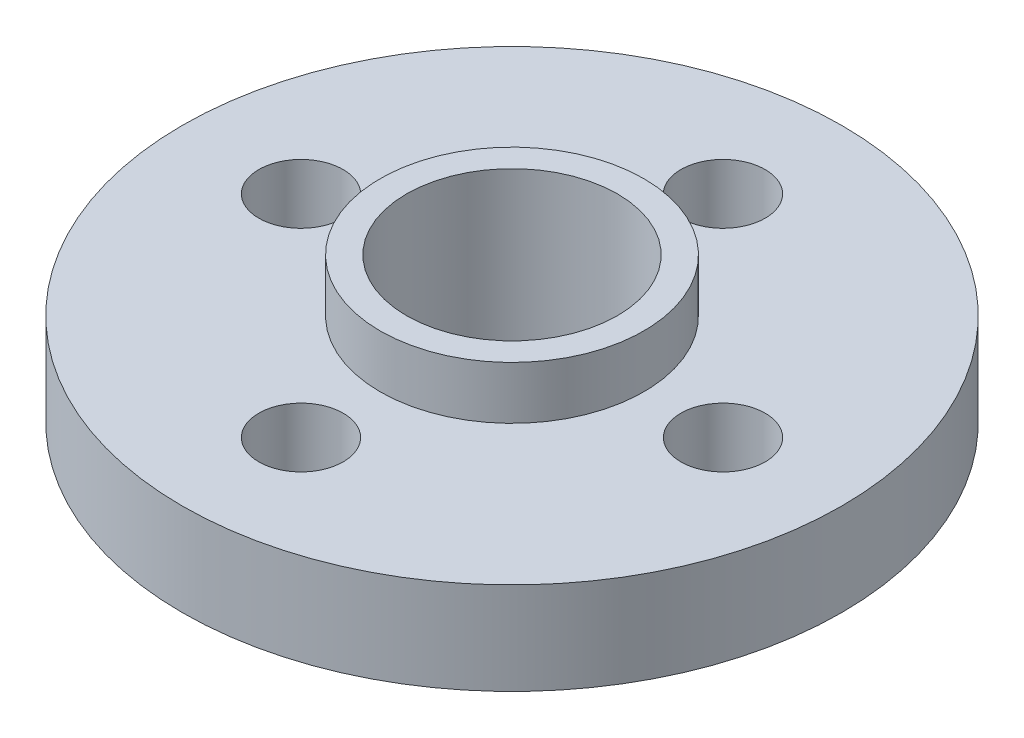
ISO-10303-21;
HEADER;
FILE_DESCRIPTION(('STEP AP214'),'2;1');
FILE_NAME('part.step','',(''),(''),'','','');
FILE_SCHEMA(('AUTOMOTIVE_DESIGN { 1 0 10303 214 1 1 1 1 }'));
ENDSEC;
DATA;
#1=APPLICATION_CONTEXT('core data for automotive mechanical design processes');
#2=APPLICATION_PROTOCOL_DEFINITION('international standard','automotive_design',2000,#1);
#3=PRODUCT_CONTEXT('',#1,'mechanical');
#4=PRODUCT('Part','Part','',(#3));
#5=PRODUCT_RELATED_PRODUCT_CATEGORY('part','',(#4));
#6=PRODUCT_DEFINITION_FORMATION('','',#4);
#7=PRODUCT_DEFINITION_CONTEXT('part definition',#1,'design');
#8=PRODUCT_DEFINITION('design','',#6,#7);
#9=PRODUCT_DEFINITION_SHAPE('','',#8);
#10=(LENGTH_UNIT() NAMED_UNIT(*) SI_UNIT(.MILLI.,.METRE.));
#11=(NAMED_UNIT(*) PLANE_ANGLE_UNIT() SI_UNIT($,.RADIAN.));
#12=(NAMED_UNIT(*) SI_UNIT($,.STERADIAN.) SOLID_ANGLE_UNIT());
#13=UNCERTAINTY_MEASURE_WITH_UNIT(LENGTH_MEASURE(1.E-05),#10,'distance_accuracy_value','');
#14=(GEOMETRIC_REPRESENTATION_CONTEXT(3) GLOBAL_UNCERTAINTY_ASSIGNED_CONTEXT((#13)) GLOBAL_UNIT_ASSIGNED_CONTEXT((#10,
#11,#12)) REPRESENTATION_CONTEXT('',''));
#15=CARTESIAN_POINT('',(0.,0.,0.));
#16=DIRECTION('',(0.,0.,1.));
#17=DIRECTION('',(1.,0.,0.));
#18=AXIS2_PLACEMENT_3D('',#15,#16,#17);
#19=CARTESIAN_POINT('',(0.,0.,0.));
#20=DIRECTION('',(0.,1.,0.));
#21=DIRECTION('',(0.,0.,1.));
#22=AXIS2_PLACEMENT_3D('',#19,#20,#21);
#23=PLANE('',#22);
#24=CARTESIAN_POINT('',(0.,0.,-8.));
#25=DIRECTION('',(0.,1.,0.));
#26=DIRECTION('',(0.,0.,1.));
#27=AXIS2_PLACEMENT_3D('',#24,#25,#26);
#28=CIRCLE('',#27,1.6);
#29=CARTESIAN_POINT('',(0.,0.,-6.4));
#30=VERTEX_POINT('',#29);
#31=EDGE_CURVE('E67',#30,#30,#28,.T.);
#32=ORIENTED_EDGE('',*,*,#31,.T.);
#33=EDGE_LOOP('',(#32));
#34=FACE_BOUND('',#33,.T.);
#35=CARTESIAN_POINT('',(8.00000000000023,0.,-2.25904099284255E-13));
#36=DIRECTION('',(0.,1.,0.));
#37=DIRECTION('',(0.,0.,1.));
#38=AXIS2_PLACEMENT_3D('',#35,#36,#37);
#39=CIRCLE('',#38,1.60000000000018);
#40=CARTESIAN_POINT('',(8.00000000000023,0.,1.59999999999995));
#41=VERTEX_POINT('',#40);
#42=EDGE_CURVE('E70',#41,#41,#39,.T.);
#43=ORIENTED_EDGE('',*,*,#42,.T.);
#44=EDGE_LOOP('',(#43));
#45=FACE_BOUND('',#44,.T.);
#46=CARTESIAN_POINT('',(4.51808198568511E-13,0.,8.));
#47=DIRECTION('',(0.,1.,0.));
#48=DIRECTION('',(0.,0.,1.));
#49=AXIS2_PLACEMENT_3D('',#46,#47,#48);
#50=CIRCLE('',#49,1.60000000000049);
#51=CARTESIAN_POINT('',(4.51808198568511E-13,0.,9.60000000000049));
#52=VERTEX_POINT('',#51);
#53=EDGE_CURVE('E73',#52,#52,#50,.T.);
#54=ORIENTED_EDGE('',*,*,#53,.T.);
#55=EDGE_LOOP('',(#54));
#56=FACE_BOUND('',#55,.T.);
#57=CARTESIAN_POINT('',(-7.99999999999977,0.,2.26883816723573E-13));
#58=DIRECTION('',(0.,1.,0.));
#59=DIRECTION('',(0.,0.,1.));
#60=AXIS2_PLACEMENT_3D('',#57,#58,#59);
#61=CIRCLE('',#60,1.60000000000036);
#62=CARTESIAN_POINT('',(-7.99999999999977,0.,1.60000000000059));
#63=VERTEX_POINT('',#62);
#64=EDGE_CURVE('E76',#63,#63,#61,.T.);
#65=ORIENTED_EDGE('',*,*,#64,.T.);
#66=EDGE_LOOP('',(#65));
#67=FACE_BOUND('',#66,.T.);
#68=CARTESIAN_POINT('',(0.,0.,0.));
#69=DIRECTION('',(0.,1.,0.));
#70=DIRECTION('',(0.,0.,1.));
#71=AXIS2_PLACEMENT_3D('',#68,#69,#70);
#72=CIRCLE('',#71,12.5);
#73=CARTESIAN_POINT('',(0.,0.,12.5));
#74=VERTEX_POINT('',#73);
#75=EDGE_CURVE('E46',#74,#74,#72,.T.);
#76=ORIENTED_EDGE('',*,*,#75,.F.);
#77=EDGE_LOOP('',(#76));
#78=FACE_BOUND('',#77,.T.);
#79=CARTESIAN_POINT('',(0.,0.,0.));
#80=DIRECTION('',(0.,1.,0.));
#81=DIRECTION('',(0.,0.,1.));
#82=AXIS2_PLACEMENT_3D('',#79,#80,#81);
#83=CIRCLE('',#82,5.);
#84=CARTESIAN_POINT('',(0.,0.,5.));
#85=VERTEX_POINT('',#84);
#86=EDGE_CURVE('E10',#85,#85,#83,.F.);
#87=ORIENTED_EDGE('',*,*,#86,.F.);
#88=EDGE_LOOP('',(#87));
#89=FACE_BOUND('',#88,.T.);
#90=ADVANCED_FACE('F35',(#34,#45,#56,#67,#78,#89),#23,.F.);
#91=CARTESIAN_POINT('',(0.,3.5,0.));
#92=DIRECTION('',(0.,1.,0.));
#93=DIRECTION('',(0.,0.,1.));
#94=AXIS2_PLACEMENT_3D('',#91,#92,#93);
#95=PLANE('',#94);
#96=CARTESIAN_POINT('',(0.,3.5,-8.));
#97=DIRECTION('',(0.,1.,0.));
#98=DIRECTION('',(0.,0.,1.));
#99=AXIS2_PLACEMENT_3D('',#96,#97,#98);
#100=CIRCLE('',#99,1.6);
#101=CARTESIAN_POINT('',(0.,3.5,-6.4));
#102=VERTEX_POINT('',#101);
#103=EDGE_CURVE('E79',#102,#102,#100,.T.);
#104=ORIENTED_EDGE('',*,*,#103,.F.);
#105=EDGE_LOOP('',(#104));
#106=FACE_BOUND('',#105,.T.);
#107=CARTESIAN_POINT('',(8.00000000000023,3.5,-2.25904099284255E-13));
#108=DIRECTION('',(0.,1.,0.));
#109=DIRECTION('',(0.,0.,1.));
#110=AXIS2_PLACEMENT_3D('',#107,#108,#109);
#111=CIRCLE('',#110,1.60000000000018);
#112=CARTESIAN_POINT('',(8.00000000000023,3.5,1.59999999999995));
#113=VERTEX_POINT('',#112);
#114=EDGE_CURVE('E86',#113,#113,#111,.T.);
#115=ORIENTED_EDGE('',*,*,#114,.F.);
#116=EDGE_LOOP('',(#115));
#117=FACE_BOUND('',#116,.T.);
#118=CARTESIAN_POINT('',(4.51808198568511E-13,3.5,8.));
#119=DIRECTION('',(0.,1.,0.));
#120=DIRECTION('',(0.,0.,1.));
#121=AXIS2_PLACEMENT_3D('',#118,#119,#120);
#122=CIRCLE('',#121,1.60000000000049);
#123=CARTESIAN_POINT('',(4.51808198568511E-13,3.5,9.60000000000049));
#124=VERTEX_POINT('',#123);
#125=EDGE_CURVE('E83',#124,#124,#122,.T.);
#126=ORIENTED_EDGE('',*,*,#125,.F.);
#127=EDGE_LOOP('',(#126));
#128=FACE_BOUND('',#127,.T.);
#129=CARTESIAN_POINT('',(-7.99999999999977,3.5,2.26883816723573E-13));
#130=DIRECTION('',(0.,1.,0.));
#131=DIRECTION('',(0.,0.,1.));
#132=AXIS2_PLACEMENT_3D('',#129,#130,#131);
#133=CIRCLE('',#132,1.60000000000036);
#134=CARTESIAN_POINT('',(-7.99999999999977,3.5,1.60000000000059));
#135=VERTEX_POINT('',#134);
#136=EDGE_CURVE('E80',#135,#135,#133,.T.);
#137=ORIENTED_EDGE('',*,*,#136,.F.);
#138=EDGE_LOOP('',(#137));
#139=FACE_BOUND('',#138,.T.);
#140=CARTESIAN_POINT('',(0.,3.5,0.));
#141=DIRECTION('',(0.,1.,0.));
#142=DIRECTION('',(0.,0.,1.));
#143=AXIS2_PLACEMENT_3D('',#140,#141,#142);
#144=CIRCLE('',#143,12.5);
#145=CARTESIAN_POINT('',(0.,3.5,12.5));
#146=VERTEX_POINT('',#145);
#147=EDGE_CURVE('E42',#146,#146,#144,.T.);
#148=ORIENTED_EDGE('',*,*,#147,.T.);
#149=EDGE_LOOP('',(#148));
#150=FACE_BOUND('',#149,.T.);
#151=CARTESIAN_POINT('',(0.,3.5,0.));
#152=DIRECTION('',(0.,1.,0.));
#153=DIRECTION('',(0.,0.,1.));
#154=AXIS2_PLACEMENT_3D('',#151,#152,#153);
#155=CIRCLE('',#154,5.);
#156=CARTESIAN_POINT('',(0.,3.5,5.));
#157=VERTEX_POINT('',#156);
#158=EDGE_CURVE('E53',#157,#157,#155,.T.);
#159=ORIENTED_EDGE('',*,*,#158,.F.);
#160=EDGE_LOOP('',(#159));
#161=FACE_BOUND('',#160,.T.);
#162=ADVANCED_FACE('F95',(#106,#117,#128,#139,#150,#161),#95,.T.);
#163=CARTESIAN_POINT('',(0.,3.5,0.));
#164=DIRECTION('',(0.,-1.,0.));
#165=DIRECTION('',(0.,0.,-1.));
#166=AXIS2_PLACEMENT_3D('',#163,#164,#165);
#167=CYLINDRICAL_SURFACE('',#166,12.5);
#168=ORIENTED_EDGE('',*,*,#147,.F.);
#169=EDGE_LOOP('',(#168));
#170=FACE_BOUND('',#169,.T.);
#171=ORIENTED_EDGE('',*,*,#75,.T.);
#172=EDGE_LOOP('',(#171));
#173=FACE_BOUND('',#172,.T.);
#174=ADVANCED_FACE('F37',(#170,#173),#167,.T.);
#175=CARTESIAN_POINT('',(0.,3.5,0.));
#176=DIRECTION('',(0.,-1.,0.));
#177=DIRECTION('',(0.,0.,-1.));
#178=AXIS2_PLACEMENT_3D('',#175,#176,#177);
#179=CYLINDRICAL_SURFACE('',#178,4.);
#180=CARTESIAN_POINT('',(0.,5.5,0.));
#181=DIRECTION('',(0.,1.,0.));
#182=DIRECTION('',(0.,0.,1.));
#183=AXIS2_PLACEMENT_3D('',#180,#181,#182);
#184=CIRCLE('',#183,4.);
#185=CARTESIAN_POINT('',(0.,5.5,4.));
#186=VERTEX_POINT('',#185);
#187=EDGE_CURVE('E56',#186,#186,#184,.T.);
#188=ORIENTED_EDGE('',*,*,#187,.T.);
#189=EDGE_LOOP('',(#188));
#190=FACE_BOUND('',#189,.T.);
#191=CARTESIAN_POINT('',(0.,-5.,0.));
#192=DIRECTION('',(0.,-1.,0.));
#193=DIRECTION('',(0.,0.,-1.));
#194=AXIS2_PLACEMENT_3D('',#191,#192,#193);
#195=CIRCLE('',#194,4.);
#196=CARTESIAN_POINT('',(0.,-5.,-4.));
#197=VERTEX_POINT('',#196);
#198=EDGE_CURVE('E64',#197,#197,#195,.T.);
#199=ORIENTED_EDGE('',*,*,#198,.T.);
#200=EDGE_LOOP('',(#199));
#201=FACE_BOUND('',#200,.T.);
#202=ADVANCED_FACE('F120',(#190,#201),#179,.F.);
#203=CARTESIAN_POINT('',(0.,5.5,0.));
#204=DIRECTION('',(0.,1.,0.));
#205=DIRECTION('',(0.,0.,1.));
#206=AXIS2_PLACEMENT_3D('',#203,#204,#205);
#207=PLANE('',#206);
#208=CARTESIAN_POINT('',(0.,5.5,0.));
#209=DIRECTION('',(0.,1.,0.));
#210=DIRECTION('',(0.,0.,1.));
#211=AXIS2_PLACEMENT_3D('',#208,#209,#210);
#212=CIRCLE('',#211,5.);
#213=CARTESIAN_POINT('',(0.,5.5,5.));
#214=VERTEX_POINT('',#213);
#215=EDGE_CURVE('E51',#214,#214,#212,.T.);
#216=ORIENTED_EDGE('',*,*,#215,.T.);
#217=EDGE_LOOP('',(#216));
#218=FACE_BOUND('',#217,.T.);
#219=ORIENTED_EDGE('',*,*,#187,.F.);
#220=EDGE_LOOP('',(#219));
#221=FACE_BOUND('',#220,.T.);
#222=ADVANCED_FACE('F110',(#218,#221),#207,.T.);
#223=CARTESIAN_POINT('',(0.,5.5,0.));
#224=DIRECTION('',(0.,-1.,0.));
#225=DIRECTION('',(0.,0.,-1.));
#226=AXIS2_PLACEMENT_3D('',#223,#224,#225);
#227=CYLINDRICAL_SURFACE('',#226,5.);
#228=ORIENTED_EDGE('',*,*,#215,.F.);
#229=EDGE_LOOP('',(#228));
#230=FACE_BOUND('',#229,.T.);
#231=ORIENTED_EDGE('',*,*,#158,.T.);
#232=EDGE_LOOP('',(#231));
#233=FACE_BOUND('',#232,.T.);
#234=ADVANCED_FACE('F107',(#230,#233),#227,.T.);
#235=CARTESIAN_POINT('',(0.,-5.,0.));
#236=DIRECTION('',(0.,-1.,0.));
#237=DIRECTION('',(0.,0.,-1.));
#238=AXIS2_PLACEMENT_3D('',#235,#236,#237);
#239=PLANE('',#238);
#240=CARTESIAN_POINT('',(0.,-5.,0.));
#241=DIRECTION('',(0.,-1.,0.));
#242=DIRECTION('',(0.,0.,-1.));
#243=AXIS2_PLACEMENT_3D('',#240,#241,#242);
#244=CIRCLE('',#243,5.);
#245=CARTESIAN_POINT('',(0.,-5.,-5.));
#246=VERTEX_POINT('',#245);
#247=EDGE_CURVE('E61',#246,#246,#244,.T.);
#248=ORIENTED_EDGE('',*,*,#247,.T.);
#249=EDGE_LOOP('',(#248));
#250=FACE_BOUND('',#249,.T.);
#251=ORIENTED_EDGE('',*,*,#198,.F.);
#252=EDGE_LOOP('',(#251));
#253=FACE_BOUND('',#252,.T.);
#254=ADVANCED_FACE('F109',(#250,#253),#239,.T.);
#255=CARTESIAN_POINT('',(0.,-5.,0.));
#256=DIRECTION('',(0.,1.,0.));
#257=DIRECTION('',(0.,0.,1.));
#258=AXIS2_PLACEMENT_3D('',#255,#256,#257);
#259=CYLINDRICAL_SURFACE('',#258,5.);
#260=ORIENTED_EDGE('',*,*,#247,.F.);
#261=EDGE_LOOP('',(#260));
#262=FACE_BOUND('',#261,.T.);
#263=ORIENTED_EDGE('',*,*,#86,.T.);
#264=EDGE_LOOP('',(#263));
#265=FACE_BOUND('',#264,.T.);
#266=ADVANCED_FACE('F117',(#262,#265),#259,.T.);
#267=CARTESIAN_POINT('',(-7.99999999999977,-5.,2.26883816723573E-13));
#268=DIRECTION('',(0.,1.,0.));
#269=DIRECTION('',(0.,0.,1.));
#270=AXIS2_PLACEMENT_3D('',#267,#268,#269);
#271=CYLINDRICAL_SURFACE('',#270,1.60000000000036);
#272=ORIENTED_EDGE('',*,*,#136,.T.);
#273=EDGE_LOOP('',(#272));
#274=FACE_BOUND('',#273,.T.);
#275=ORIENTED_EDGE('',*,*,#64,.F.);
#276=EDGE_LOOP('',(#275));
#277=FACE_BOUND('',#276,.T.);
#278=ADVANCED_FACE('F162',(#274,#277),#271,.F.);
#279=CARTESIAN_POINT('',(4.51808198568511E-13,-5.,8.));
#280=DIRECTION('',(0.,1.,0.));
#281=DIRECTION('',(0.,0.,1.));
#282=AXIS2_PLACEMENT_3D('',#279,#280,#281);
#283=CYLINDRICAL_SURFACE('',#282,1.60000000000049);
#284=ORIENTED_EDGE('',*,*,#125,.T.);
#285=EDGE_LOOP('',(#284));
#286=FACE_BOUND('',#285,.T.);
#287=ORIENTED_EDGE('',*,*,#53,.F.);
#288=EDGE_LOOP('',(#287));
#289=FACE_BOUND('',#288,.T.);
#290=ADVANCED_FACE('F167',(#286,#289),#283,.F.);
#291=CARTESIAN_POINT('',(8.00000000000023,-5.,-2.25904099284255E-13));
#292=DIRECTION('',(0.,1.,0.));
#293=DIRECTION('',(0.,0.,1.));
#294=AXIS2_PLACEMENT_3D('',#291,#292,#293);
#295=CYLINDRICAL_SURFACE('',#294,1.60000000000018);
#296=ORIENTED_EDGE('',*,*,#114,.T.);
#297=EDGE_LOOP('',(#296));
#298=FACE_BOUND('',#297,.T.);
#299=ORIENTED_EDGE('',*,*,#42,.F.);
#300=EDGE_LOOP('',(#299));
#301=FACE_BOUND('',#300,.T.);
#302=ADVANCED_FACE('F180',(#298,#301),#295,.F.);
#303=CARTESIAN_POINT('',(0.,-5.,-8.));
#304=DIRECTION('',(0.,1.,0.));
#305=DIRECTION('',(0.,0.,1.));
#306=AXIS2_PLACEMENT_3D('',#303,#304,#305);
#307=CYLINDRICAL_SURFACE('',#306,1.6);
#308=ORIENTED_EDGE('',*,*,#103,.T.);
#309=EDGE_LOOP('',(#308));
#310=FACE_BOUND('',#309,.T.);
#311=ORIENTED_EDGE('',*,*,#31,.F.);
#312=EDGE_LOOP('',(#311));
#313=FACE_BOUND('',#312,.T.);
#314=ADVANCED_FACE('F92',(#310,#313),#307,.F.);
#315=CLOSED_SHELL('',(#90,#162,#174,#202,#222,#234,#254,#266,#278,#290,#302,#314));
#316=MANIFOLD_SOLID_BREP('B2',#315);
#317=ADVANCED_BREP_SHAPE_REPRESENTATION('',(#18,#316),#14);
#318=SHAPE_DEFINITION_REPRESENTATION(#9,#317);
ENDSEC;
END-ISO-10303-21;
